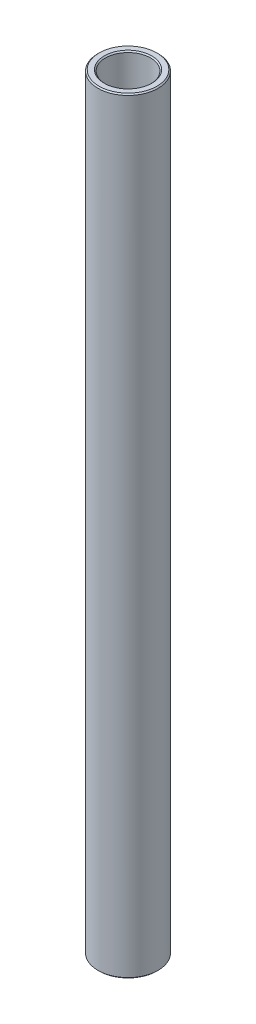
ISO-10303-21;
HEADER;
FILE_DESCRIPTION(('STEP AP214'),'2;1');
FILE_NAME('part.step','',(''),(''),'','','');
FILE_SCHEMA(('AUTOMOTIVE_DESIGN { 1 0 10303 214 1 1 1 1 }'));
ENDSEC;
DATA;
#1=APPLICATION_CONTEXT('core data for automotive mechanical design processes');
#2=APPLICATION_PROTOCOL_DEFINITION('international standard','automotive_design',2000,#1);
#3=PRODUCT_CONTEXT('',#1,'mechanical');
#4=PRODUCT('Part','Part','',(#3));
#5=PRODUCT_RELATED_PRODUCT_CATEGORY('part','',(#4));
#6=PRODUCT_DEFINITION_FORMATION('','',#4);
#7=PRODUCT_DEFINITION_CONTEXT('part definition',#1,'design');
#8=PRODUCT_DEFINITION('design','',#6,#7);
#9=PRODUCT_DEFINITION_SHAPE('','',#8);
#10=(LENGTH_UNIT() NAMED_UNIT(*) SI_UNIT(.MILLI.,.METRE.));
#11=(NAMED_UNIT(*) PLANE_ANGLE_UNIT() SI_UNIT($,.RADIAN.));
#12=(NAMED_UNIT(*) SI_UNIT($,.STERADIAN.) SOLID_ANGLE_UNIT());
#13=UNCERTAINTY_MEASURE_WITH_UNIT(LENGTH_MEASURE(1.E-05),#10,'distance_accuracy_value','');
#14=(GEOMETRIC_REPRESENTATION_CONTEXT(3) GLOBAL_UNCERTAINTY_ASSIGNED_CONTEXT((#13)) GLOBAL_UNIT_ASSIGNED_CONTEXT((#10,
#11,#12)) REPRESENTATION_CONTEXT('',''));
#15=CARTESIAN_POINT('',(0.,0.,0.));
#16=DIRECTION('',(0.,0.,1.));
#17=DIRECTION('',(1.,0.,0.));
#18=AXIS2_PLACEMENT_3D('',#15,#16,#17);
#19=CARTESIAN_POINT('',(6.3500000000003,124.259188543994,0.));
#20=DIRECTION('',(-2.90601895710435E-12,-1.,0.));
#21=DIRECTION('',(1.,-2.90601895710435E-12,0.));
#22=AXIS2_PLACEMENT_3D('',#19,#20,#21);
#23=PLANE('',#22);
#24=CARTESIAN_POINT('',(2.76798305664659E-11,124.259188544013,0.));
#25=DIRECTION('',(-2.90601895710435E-12,-1.,0.));
#26=DIRECTION('',(1.,-2.90601895710435E-12,0.));
#27=AXIS2_PLACEMENT_3D('',#24,#25,#26);
#28=CIRCLE('',#27,5.01649999997001);
#29=CARTESIAN_POINT('',(5.01649999999769,124.259188543998,0.));
#30=VERTEX_POINT('',#29);
#31=EDGE_CURVE('E10',#30,#30,#28,.F.);
#32=ORIENTED_EDGE('',*,*,#31,.T.);
#33=EDGE_LOOP('',(#32));
#34=FACE_BOUND('',#33,.T.);
#35=CARTESIAN_POINT('',(2.76798305664658E-11,124.259188544013,0.));
#36=DIRECTION('',(-2.90601895710435E-12,-1.,0.));
#37=DIRECTION('',(1.,-2.90601895710435E-12,0.));
#38=AXIS2_PLACEMENT_3D('',#35,#36,#37);
#39=CIRCLE('',#38,6.09599999997029);
#40=CARTESIAN_POINT('',(6.09599999999798,124.259188543995,0.));
#41=VERTEX_POINT('',#40);
#42=EDGE_CURVE('E38',#41,#41,#39,.T.);
#43=ORIENTED_EDGE('',*,*,#42,.T.);
#44=EDGE_LOOP('',(#43));
#45=FACE_BOUND('',#44,.T.);
#46=ADVANCED_FACE('F31',(#34,#45),#23,.T.);
#47=CARTESIAN_POINT('',(0.,114.734188543997,0.));
#48=DIRECTION('',(-2.90601895710435E-12,-1.,0.));
#49=DIRECTION('',(1.,-2.90601895710435E-12,0.));
#50=AXIS2_PLACEMENT_3D('',#47,#48,#49);
#51=CYLINDRICAL_SURFACE('',#50,4.76249999973733);
#52=CARTESIAN_POINT('',(4.96953453659632E-10,285.742520215312,0.));
#53=DIRECTION('',(2.90601895710375E-12,1.,0.));
#54=DIRECTION('',(-1.,2.90601895710375E-12,0.));
#55=AXIS2_PLACEMENT_3D('',#52,#53,#54);
#56=CIRCLE('',#55,4.76249999973733);
#57=CARTESIAN_POINT('',(-4.76249999924037,285.742520215326,0.));
#58=VERTEX_POINT('',#57);
#59=EDGE_CURVE('E42',#58,#58,#56,.T.);
#60=ORIENTED_EDGE('',*,*,#59,.T.);
#61=EDGE_LOOP('',(#60));
#62=FACE_BOUND('',#61,.T.);
#63=CARTESIAN_POINT('',(2.84179593822466E-11,124.513188544245,0.));
#64=DIRECTION('',(-2.90601895710435E-12,-1.,0.));
#65=DIRECTION('',(1.,-2.90601895710435E-12,0.));
#66=AXIS2_PLACEMENT_3D('',#63,#64,#65);
#67=CIRCLE('',#66,4.76249999973733);
#68=CARTESIAN_POINT('',(4.76249999976575,124.513188544232,0.));
#69=VERTEX_POINT('',#68);
#70=EDGE_CURVE('E46',#69,#69,#67,.T.);
#71=ORIENTED_EDGE('',*,*,#70,.T.);
#72=EDGE_LOOP('',(#71));
#73=FACE_BOUND('',#72,.T.);
#74=ADVANCED_FACE('F75',(#62,#73),#51,.F.);
#75=CARTESIAN_POINT('',(4.76250000000001,285.996520215066,0.));
#76=DIRECTION('',(2.90601895710435E-12,1.,0.));
#77=DIRECTION('',(-1.,2.90601895710435E-12,0.));
#78=AXIS2_PLACEMENT_3D('',#75,#76,#77);
#79=PLANE('',#78);
#80=CARTESIAN_POINT('',(4.9769158247406E-10,285.99652021508,0.));
#81=DIRECTION('',(2.90601895710435E-12,1.,0.));
#82=DIRECTION('',(-1.,2.90601895710435E-12,0.));
#83=AXIS2_PLACEMENT_3D('',#80,#81,#82);
#84=CIRCLE('',#83,6.0959999995049);
#85=CARTESIAN_POINT('',(-6.09599999900721,285.996520215097,0.));
#86=VERTEX_POINT('',#85);
#87=EDGE_CURVE('E51',#86,#86,#84,.T.);
#88=ORIENTED_EDGE('',*,*,#87,.T.);
#89=EDGE_LOOP('',(#88));
#90=FACE_BOUND('',#89,.T.);
#91=CARTESIAN_POINT('',(4.9769158247406E-10,285.99652021508,0.));
#92=DIRECTION('',(2.90601895710435E-12,1.,0.));
#93=DIRECTION('',(-1.,2.90601895710435E-12,0.));
#94=AXIS2_PLACEMENT_3D('',#91,#92,#93);
#95=CIRCLE('',#94,5.01649999950457);
#96=CARTESIAN_POINT('',(-5.01649999900688,285.996520215094,0.));
#97=VERTEX_POINT('',#96);
#98=EDGE_CURVE('E54',#97,#97,#95,.F.);
#99=ORIENTED_EDGE('',*,*,#98,.T.);
#100=EDGE_LOOP('',(#99));
#101=FACE_BOUND('',#100,.T.);
#102=ADVANCED_FACE('F80',(#90,#101),#79,.T.);
#103=CARTESIAN_POINT('',(0.,114.734188543997,0.));
#104=DIRECTION('',(-2.90601895710435E-12,-1.,0.));
#105=DIRECTION('',(1.,-2.90601895710435E-12,0.));
#106=AXIS2_PLACEMENT_3D('',#103,#104,#105);
#107=CYLINDRICAL_SURFACE('',#106,6.3499999997376);
#108=CARTESIAN_POINT('',(4.96953453658279E-10,285.742520214847,0.));
#109=DIRECTION('',(2.90601895710443E-12,1.,0.));
#110=DIRECTION('',(-1.,2.90601895710443E-12,0.));
#111=AXIS2_PLACEMENT_3D('',#108,#109,#110);
#112=CIRCLE('',#111,6.3499999997376);
#113=CARTESIAN_POINT('',(-6.34999999924065,285.742520214865,0.));
#114=VERTEX_POINT('',#113);
#115=EDGE_CURVE('E57',#114,#114,#112,.F.);
#116=ORIENTED_EDGE('',*,*,#115,.T.);
#117=EDGE_LOOP('',(#116));
#118=FACE_BOUND('',#117,.T.);
#119=CARTESIAN_POINT('',(2.84179593808942E-11,124.51318854378,0.));
#120=DIRECTION('',(-2.90601895710435E-12,-1.,0.));
#121=DIRECTION('',(1.,-2.90601895710435E-12,0.));
#122=AXIS2_PLACEMENT_3D('',#119,#120,#121);
#123=CIRCLE('',#122,6.3499999997376);
#124=CARTESIAN_POINT('',(6.34999999976602,124.513188543762,0.));
#125=VERTEX_POINT('',#124);
#126=EDGE_CURVE('E60',#125,#125,#123,.F.);
#127=ORIENTED_EDGE('',*,*,#126,.T.);
#128=EDGE_LOOP('',(#127));
#129=FACE_BOUND('',#128,.T.);
#130=ADVANCED_FACE('F64',(#118,#129),#107,.T.);
#131=CARTESIAN_POINT('',(4.96953453658279E-10,285.742520214847,0.));
#132=DIRECTION('',(-2.90601895710443E-12,-1.,0.));
#133=DIRECTION('',(1.,-2.90601895710443E-12,0.));
#134=AXIS2_PLACEMENT_3D('',#131,#132,#133);
#135=CONICAL_SURFACE('',#134,6.3499999997376,0.785398163397344);
#136=ORIENTED_EDGE('',*,*,#87,.F.);
#137=EDGE_LOOP('',(#136));
#138=FACE_BOUND('',#137,.T.);
#139=ORIENTED_EDGE('',*,*,#115,.F.);
#140=EDGE_LOOP('',(#139));
#141=FACE_BOUND('',#140,.T.);
#142=ADVANCED_FACE('F85',(#138,#141),#135,.T.);
#143=CARTESIAN_POINT('',(4.9769158247406E-10,285.99652021508,0.));
#144=DIRECTION('',(2.90601895710375E-12,1.,0.));
#145=DIRECTION('',(-1.,2.90601895710375E-12,0.));
#146=AXIS2_PLACEMENT_3D('',#143,#144,#145);
#147=CONICAL_SURFACE('',#146,5.0164999995046,0.785398163397237);
#148=ORIENTED_EDGE('',*,*,#59,.F.);
#149=EDGE_LOOP('',(#148));
#150=FACE_BOUND('',#149,.T.);
#151=ORIENTED_EDGE('',*,*,#98,.F.);
#152=EDGE_LOOP('',(#151));
#153=FACE_BOUND('',#152,.T.);
#154=ADVANCED_FACE('F72',(#150,#153),#147,.F.);
#155=CARTESIAN_POINT('',(2.84179593822466E-11,124.513188544245,0.));
#156=DIRECTION('',(-2.90601895710435E-12,-1.,0.));
#157=DIRECTION('',(1.,-2.90601895710435E-12,0.));
#158=AXIS2_PLACEMENT_3D('',#155,#156,#157);
#159=CONICAL_SURFACE('',#158,4.76249999973733,0.785398163397455);
#160=ORIENTED_EDGE('',*,*,#31,.F.);
#161=EDGE_LOOP('',(#160));
#162=FACE_BOUND('',#161,.T.);
#163=ORIENTED_EDGE('',*,*,#70,.F.);
#164=EDGE_LOOP('',(#163));
#165=FACE_BOUND('',#164,.T.);
#166=ADVANCED_FACE('F68',(#162,#165),#159,.F.);
#167=CARTESIAN_POINT('',(2.76798305664659E-11,124.259188544013,0.));
#168=DIRECTION('',(2.90601895710435E-12,1.,0.));
#169=DIRECTION('',(-1.,2.90601895710435E-12,0.));
#170=AXIS2_PLACEMENT_3D('',#167,#168,#169);
#171=CONICAL_SURFACE('',#170,6.0959999999703,0.785398163397453);
#172=ORIENTED_EDGE('',*,*,#126,.F.);
#173=EDGE_LOOP('',(#172));
#174=FACE_BOUND('',#173,.T.);
#175=ORIENTED_EDGE('',*,*,#42,.F.);
#176=EDGE_LOOP('',(#175));
#177=FACE_BOUND('',#176,.T.);
#178=ADVANCED_FACE('F33',(#174,#177),#171,.T.);
#179=CLOSED_SHELL('',(#46,#74,#102,#130,#142,#154,#166,#178));
#180=MANIFOLD_SOLID_BREP('B2',#179);
#181=ADVANCED_BREP_SHAPE_REPRESENTATION('',(#18,#180),#14);
#182=SHAPE_DEFINITION_REPRESENTATION(#9,#181);
ENDSEC;
END-ISO-10303-21;
